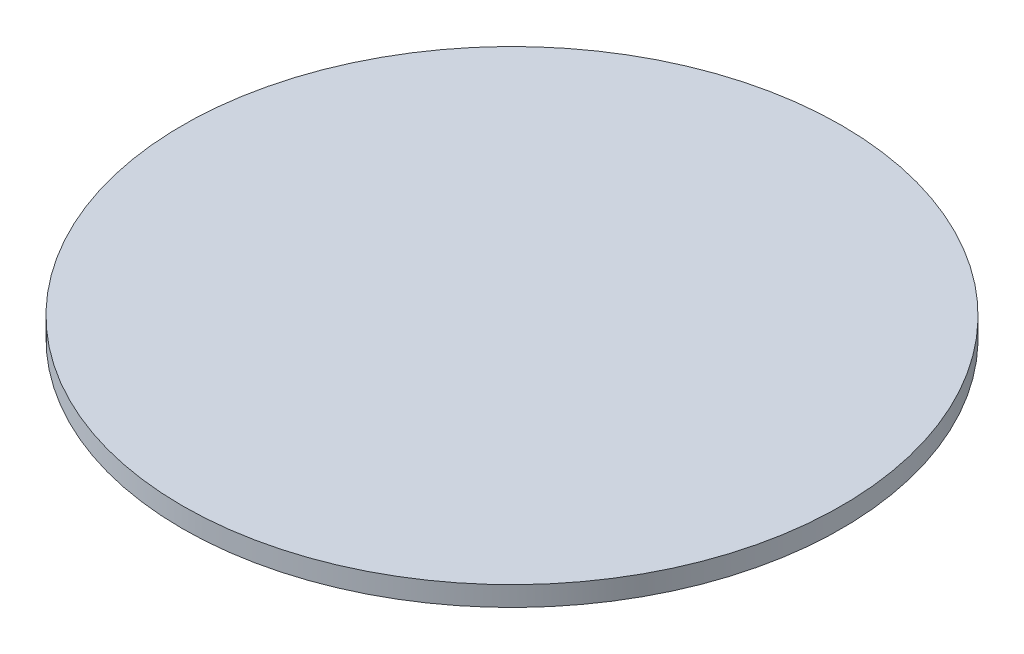
ISO-10303-21;
HEADER;
FILE_DESCRIPTION(('STEP AP214'),'2;1');
FILE_NAME('part.step','',(''),(''),'','','');
FILE_SCHEMA(('AUTOMOTIVE_DESIGN { 1 0 10303 214 1 1 1 1 }'));
ENDSEC;
DATA;
#1=APPLICATION_CONTEXT('core data for automotive mechanical design processes');
#2=APPLICATION_PROTOCOL_DEFINITION('international standard','automotive_design',2000,#1);
#3=PRODUCT_CONTEXT('',#1,'mechanical');
#4=PRODUCT('Part','Part','',(#3));
#5=PRODUCT_RELATED_PRODUCT_CATEGORY('part','',(#4));
#6=PRODUCT_DEFINITION_FORMATION('','',#4);
#7=PRODUCT_DEFINITION_CONTEXT('part definition',#1,'design');
#8=PRODUCT_DEFINITION('design','',#6,#7);
#9=PRODUCT_DEFINITION_SHAPE('','',#8);
#10=(LENGTH_UNIT() NAMED_UNIT(*) SI_UNIT(.MILLI.,.METRE.));
#11=(NAMED_UNIT(*) PLANE_ANGLE_UNIT() SI_UNIT($,.RADIAN.));
#12=(NAMED_UNIT(*) SI_UNIT($,.STERADIAN.) SOLID_ANGLE_UNIT());
#13=UNCERTAINTY_MEASURE_WITH_UNIT(LENGTH_MEASURE(1.E-05),#10,'distance_accuracy_value','');
#14=(GEOMETRIC_REPRESENTATION_CONTEXT(3) GLOBAL_UNCERTAINTY_ASSIGNED_CONTEXT((#13)) GLOBAL_UNIT_ASSIGNED_CONTEXT((#10,
#11,#12)) REPRESENTATION_CONTEXT('',''));
#15=CARTESIAN_POINT('',(0.,0.,0.));
#16=DIRECTION('',(0.,0.,1.));
#17=DIRECTION('',(1.,0.,0.));
#18=AXIS2_PLACEMENT_3D('',#15,#16,#17);
#19=CARTESIAN_POINT('',(0.,0.762,0.));
#20=DIRECTION('',(0.,-1.,0.));
#21=DIRECTION('',(0.,0.,-1.));
#22=AXIS2_PLACEMENT_3D('',#19,#20,#21);
#23=CYLINDRICAL_SURFACE('',#22,12.7);
#24=CARTESIAN_POINT('',(0.,0.762,0.));
#25=DIRECTION('',(0.,1.,0.));
#26=DIRECTION('',(0.,0.,1.));
#27=AXIS2_PLACEMENT_3D('',#24,#25,#26);
#28=CIRCLE('',#27,12.7);
#29=CARTESIAN_POINT('',(0.,0.762,12.7));
#30=VERTEX_POINT('',#29);
#31=EDGE_CURVE('E10',#30,#30,#28,.T.);
#32=ORIENTED_EDGE('',*,*,#31,.F.);
#33=EDGE_LOOP('',(#32));
#34=FACE_BOUND('',#33,.T.);
#35=CARTESIAN_POINT('',(0.,0.,0.));
#36=DIRECTION('',(0.,1.,0.));
#37=DIRECTION('',(0.,0.,1.));
#38=AXIS2_PLACEMENT_3D('',#35,#36,#37);
#39=CIRCLE('',#38,12.7);
#40=CARTESIAN_POINT('',(0.,0.,12.7));
#41=VERTEX_POINT('',#40);
#42=EDGE_CURVE('E46',#41,#41,#39,.T.);
#43=ORIENTED_EDGE('',*,*,#42,.T.);
#44=EDGE_LOOP('',(#43));
#45=FACE_BOUND('',#44,.T.);
#46=ADVANCED_FACE('F43',(#34,#45),#23,.T.);
#47=CARTESIAN_POINT('',(0.,0.762,0.));
#48=DIRECTION('',(0.,1.,0.));
#49=DIRECTION('',(0.,0.,1.));
#50=AXIS2_PLACEMENT_3D('',#47,#48,#49);
#51=PLANE('',#50);
#52=ORIENTED_EDGE('',*,*,#31,.T.);
#53=EDGE_LOOP('',(#52));
#54=FACE_BOUND('',#53,.T.);
#55=ADVANCED_FACE('F58',(#54),#51,.T.);
#56=CARTESIAN_POINT('',(0.,0.,0.));
#57=DIRECTION('',(0.,1.,0.));
#58=DIRECTION('',(0.,0.,1.));
#59=AXIS2_PLACEMENT_3D('',#56,#57,#58);
#60=PLANE('',#59);
#61=ORIENTED_EDGE('',*,*,#42,.F.);
#62=EDGE_LOOP('',(#61));
#63=FACE_BOUND('',#62,.T.);
#64=ADVANCED_FACE('F56',(#63),#60,.F.);
#65=CLOSED_SHELL('',(#46,#55,#64));
#66=MANIFOLD_SOLID_BREP('B2',#65);
#67=ADVANCED_BREP_SHAPE_REPRESENTATION('',(#18,#66),#14);
#68=SHAPE_DEFINITION_REPRESENTATION(#9,#67);
ENDSEC;
END-ISO-10303-21;
